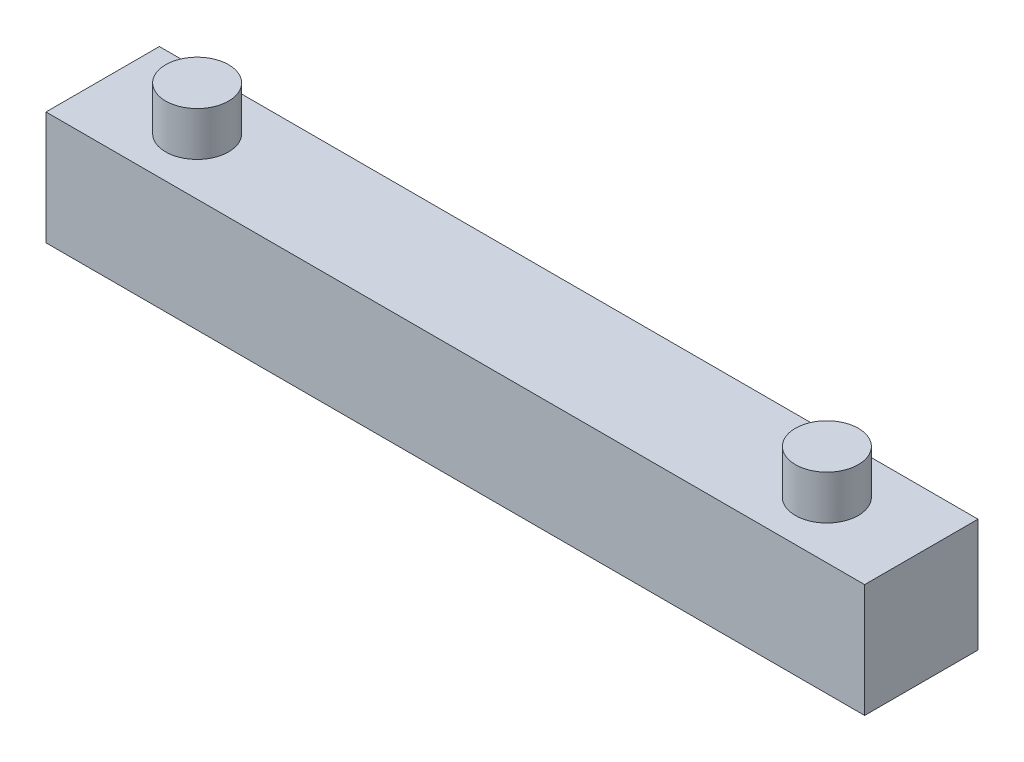
ISO-10303-21;
HEADER;
FILE_DESCRIPTION(('STEP AP214'),'2;1');
FILE_NAME('part.step','',(''),(''),'','','');
FILE_SCHEMA(('AUTOMOTIVE_DESIGN { 1 0 10303 214 1 1 1 1 }'));
ENDSEC;
DATA;
#1=APPLICATION_CONTEXT('core data for automotive mechanical design processes');
#2=APPLICATION_PROTOCOL_DEFINITION('international standard','automotive_design',2000,#1);
#3=PRODUCT_CONTEXT('',#1,'mechanical');
#4=PRODUCT('Part','Part','',(#3));
#5=PRODUCT_RELATED_PRODUCT_CATEGORY('part','',(#4));
#6=PRODUCT_DEFINITION_FORMATION('','',#4);
#7=PRODUCT_DEFINITION_CONTEXT('part definition',#1,'design');
#8=PRODUCT_DEFINITION('design','',#6,#7);
#9=PRODUCT_DEFINITION_SHAPE('','',#8);
#10=(LENGTH_UNIT() NAMED_UNIT(*) SI_UNIT(.MILLI.,.METRE.));
#11=(NAMED_UNIT(*) PLANE_ANGLE_UNIT() SI_UNIT($,.RADIAN.));
#12=(NAMED_UNIT(*) SI_UNIT($,.STERADIAN.) SOLID_ANGLE_UNIT());
#13=UNCERTAINTY_MEASURE_WITH_UNIT(LENGTH_MEASURE(1.E-05),#10,'distance_accuracy_value','');
#14=(GEOMETRIC_REPRESENTATION_CONTEXT(3) GLOBAL_UNCERTAINTY_ASSIGNED_CONTEXT((#13)) GLOBAL_UNIT_ASSIGNED_CONTEXT((#10,
#11,#12)) REPRESENTATION_CONTEXT('',''));
#15=CARTESIAN_POINT('',(0.,0.,0.));
#16=DIRECTION('',(0.,0.,1.));
#17=DIRECTION('',(1.,0.,0.));
#18=AXIS2_PLACEMENT_3D('',#15,#16,#17);
#19=CARTESIAN_POINT('',(65.,9.,9.));
#20=DIRECTION('',(0.,-1.,0.));
#21=DIRECTION('',(1.,0.,0.));
#22=AXIS2_PLACEMENT_3D('',#19,#20,#21);
#23=PLANE('',#22);
#24=CARTESIAN_POINT('',(57.5,9.,4.5));
#25=DIRECTION('',(0.,-1.,0.));
#26=DIRECTION('',(1.,0.,0.));
#27=AXIS2_PLACEMENT_3D('',#24,#25,#26);
#28=CIRCLE('',#27,2.49999999999999);
#29=CARTESIAN_POINT('',(60.,9.,4.5));
#30=VERTEX_POINT('',#29);
#31=EDGE_CURVE('E42',#30,#30,#28,.F.);
#32=ORIENTED_EDGE('',*,*,#31,.F.);
#33=EDGE_LOOP('',(#32));
#34=FACE_BOUND('',#33,.T.);
#35=DIRECTION('',(-1.,0.,0.));
#36=VECTOR('',#35,1.);
#37=CARTESIAN_POINT('',(65.,9.,0.));
#38=LINE('',#37,#36);
#39=CARTESIAN_POINT('',(65.,9.,0.));
#40=VERTEX_POINT('',#39);
#41=CARTESIAN_POINT('',(0.,8.99999999999999,0.));
#42=VERTEX_POINT('',#41);
#43=EDGE_CURVE('E73',#40,#42,#38,.T.);
#44=ORIENTED_EDGE('',*,*,#43,.T.);
#45=DIRECTION('',(0.,0.,-1.));
#46=VECTOR('',#45,1.);
#47=CARTESIAN_POINT('',(0.,8.99999999999999,9.));
#48=LINE('',#47,#46);
#49=CARTESIAN_POINT('',(0.,8.99999999999999,9.));
#50=VERTEX_POINT('',#49);
#51=EDGE_CURVE('E97',#50,#42,#48,.T.);
#52=ORIENTED_EDGE('',*,*,#51,.F.);
#53=DIRECTION('',(-1.,0.,0.));
#54=VECTOR('',#53,1.);
#55=CARTESIAN_POINT('',(65.,9.,9.));
#56=LINE('',#55,#54);
#57=CARTESIAN_POINT('',(65.,9.,9.));
#58=VERTEX_POINT('',#57);
#59=EDGE_CURVE('E50',#58,#50,#56,.T.);
#60=ORIENTED_EDGE('',*,*,#59,.F.);
#61=DIRECTION('',(0.,0.,-1.));
#62=VECTOR('',#61,1.);
#63=CARTESIAN_POINT('',(65.,9.,9.));
#64=LINE('',#63,#62);
#65=EDGE_CURVE('E93',#58,#40,#64,.T.);
#66=ORIENTED_EDGE('',*,*,#65,.T.);
#67=EDGE_LOOP('',(#44,#52,#60,#66));
#68=FACE_BOUND('',#67,.T.);
#69=CARTESIAN_POINT('',(7.5,8.99999999999999,4.5));
#70=DIRECTION('',(0.,-1.,0.));
#71=DIRECTION('',(1.,0.,0.));
#72=AXIS2_PLACEMENT_3D('',#69,#70,#71);
#73=CIRCLE('',#72,2.5);
#74=CARTESIAN_POINT('',(10.,8.99999999999999,4.5));
#75=VERTEX_POINT('',#74);
#76=EDGE_CURVE('E11',#75,#75,#73,.F.);
#77=ORIENTED_EDGE('',*,*,#76,.F.);
#78=EDGE_LOOP('',(#77));
#79=FACE_BOUND('',#78,.T.);
#80=ADVANCED_FACE('F33',(#34,#68,#79),#23,.F.);
#81=CARTESIAN_POINT('',(0.,8.99999999999999,9.));
#82=DIRECTION('',(1.,0.,0.));
#83=DIRECTION('',(0.,0.,-1.));
#84=AXIS2_PLACEMENT_3D('',#81,#82,#83);
#85=PLANE('',#84);
#86=DIRECTION('',(0.,-1.,0.));
#87=VECTOR('',#86,1.);
#88=CARTESIAN_POINT('',(0.,8.99999999999999,0.));
#89=LINE('',#88,#87);
#90=CARTESIAN_POINT('',(0.,0.,0.));
#91=VERTEX_POINT('',#90);
#92=EDGE_CURVE('E101',#42,#91,#89,.T.);
#93=ORIENTED_EDGE('',*,*,#92,.T.);
#94=DIRECTION('',(0.,0.,-1.));
#95=VECTOR('',#94,1.);
#96=CARTESIAN_POINT('',(0.,0.,9.));
#97=LINE('',#96,#95);
#98=CARTESIAN_POINT('',(0.,0.,9.));
#99=VERTEX_POINT('',#98);
#100=EDGE_CURVE('E92',#99,#91,#97,.T.);
#101=ORIENTED_EDGE('',*,*,#100,.F.);
#102=DIRECTION('',(0.,-1.,0.));
#103=VECTOR('',#102,1.);
#104=CARTESIAN_POINT('',(0.,8.99999999999999,9.));
#105=LINE('',#104,#103);
#106=EDGE_CURVE('E86',#50,#99,#105,.T.);
#107=ORIENTED_EDGE('',*,*,#106,.F.);
#108=ORIENTED_EDGE('',*,*,#51,.T.);
#109=EDGE_LOOP('',(#93,#101,#107,#108));
#110=FACE_BOUND('',#109,.T.);
#111=ADVANCED_FACE('F35',(#110),#85,.F.);
#112=CARTESIAN_POINT('',(0.,0.,9.));
#113=DIRECTION('',(0.,1.,0.));
#114=DIRECTION('',(0.,0.,1.));
#115=AXIS2_PLACEMENT_3D('',#112,#113,#114);
#116=PLANE('',#115);
#117=DIRECTION('',(1.,0.,0.));
#118=VECTOR('',#117,1.);
#119=CARTESIAN_POINT('',(0.,0.,0.));
#120=LINE('',#119,#118);
#121=CARTESIAN_POINT('',(65.,0.,0.));
#122=VERTEX_POINT('',#121);
#123=EDGE_CURVE('E91',#91,#122,#120,.T.);
#124=ORIENTED_EDGE('',*,*,#123,.T.);
#125=DIRECTION('',(0.,0.,-1.));
#126=VECTOR('',#125,1.);
#127=CARTESIAN_POINT('',(65.,0.,9.));
#128=LINE('',#127,#126);
#129=CARTESIAN_POINT('',(65.,0.,9.));
#130=VERTEX_POINT('',#129);
#131=EDGE_CURVE('E89',#130,#122,#128,.T.);
#132=ORIENTED_EDGE('',*,*,#131,.F.);
#133=DIRECTION('',(1.,0.,0.));
#134=VECTOR('',#133,1.);
#135=CARTESIAN_POINT('',(0.,0.,9.));
#136=LINE('',#135,#134);
#137=EDGE_CURVE('E81',#99,#130,#136,.T.);
#138=ORIENTED_EDGE('',*,*,#137,.F.);
#139=ORIENTED_EDGE('',*,*,#100,.T.);
#140=EDGE_LOOP('',(#124,#132,#138,#139));
#141=FACE_BOUND('',#140,.T.);
#142=ADVANCED_FACE('F90',(#141),#116,.F.);
#143=CARTESIAN_POINT('',(65.,0.,9.));
#144=DIRECTION('',(-1.,0.,0.));
#145=DIRECTION('',(0.,0.,1.));
#146=AXIS2_PLACEMENT_3D('',#143,#144,#145);
#147=PLANE('',#146);
#148=DIRECTION('',(0.,1.,0.));
#149=VECTOR('',#148,1.);
#150=CARTESIAN_POINT('',(65.,0.,0.));
#151=LINE('',#150,#149);
#152=EDGE_CURVE('E67',#122,#40,#151,.T.);
#153=ORIENTED_EDGE('',*,*,#152,.T.);
#154=ORIENTED_EDGE('',*,*,#65,.F.);
#155=DIRECTION('',(0.,1.,0.));
#156=VECTOR('',#155,1.);
#157=CARTESIAN_POINT('',(65.,0.,9.));
#158=LINE('',#157,#156);
#159=EDGE_CURVE('E84',#130,#58,#158,.T.);
#160=ORIENTED_EDGE('',*,*,#159,.F.);
#161=ORIENTED_EDGE('',*,*,#131,.T.);
#162=EDGE_LOOP('',(#153,#154,#160,#161));
#163=FACE_BOUND('',#162,.T.);
#164=ADVANCED_FACE('F95',(#163),#147,.F.);
#165=CARTESIAN_POINT('',(0.,0.,9.));
#166=DIRECTION('',(0.,0.,1.));
#167=DIRECTION('',(1.,0.,0.));
#168=AXIS2_PLACEMENT_3D('',#165,#166,#167);
#169=PLANE('',#168);
#170=ORIENTED_EDGE('',*,*,#106,.T.);
#171=ORIENTED_EDGE('',*,*,#137,.T.);
#172=ORIENTED_EDGE('',*,*,#159,.T.);
#173=ORIENTED_EDGE('',*,*,#59,.T.);
#174=EDGE_LOOP('',(#170,#171,#172,#173));
#175=FACE_BOUND('',#174,.T.);
#176=ADVANCED_FACE('F82',(#175),#169,.T.);
#177=CARTESIAN_POINT('',(0.,0.,0.));
#178=DIRECTION('',(0.,0.,1.));
#179=DIRECTION('',(1.,0.,0.));
#180=AXIS2_PLACEMENT_3D('',#177,#178,#179);
#181=PLANE('',#180);
#182=ORIENTED_EDGE('',*,*,#92,.F.);
#183=ORIENTED_EDGE('',*,*,#43,.F.);
#184=ORIENTED_EDGE('',*,*,#152,.F.);
#185=ORIENTED_EDGE('',*,*,#123,.F.);
#186=EDGE_LOOP('',(#182,#183,#184,#185));
#187=FACE_BOUND('',#186,.T.);
#188=ADVANCED_FACE('F138',(#187),#181,.F.);
#189=CARTESIAN_POINT('',(57.5,12.5,4.5));
#190=DIRECTION('',(0.,-1.,0.));
#191=DIRECTION('',(1.,0.,0.));
#192=AXIS2_PLACEMENT_3D('',#189,#190,#191);
#193=CYLINDRICAL_SURFACE('',#192,2.49999999999999);
#194=CARTESIAN_POINT('',(57.5,12.5,4.5));
#195=DIRECTION('',(0.,1.,0.));
#196=DIRECTION('',(-1.,0.,0.));
#197=AXIS2_PLACEMENT_3D('',#194,#195,#196);
#198=CIRCLE('',#197,2.49999999999999);
#199=CARTESIAN_POINT('',(55.,12.5,4.5));
#200=VERTEX_POINT('',#199);
#201=EDGE_CURVE('E104',#200,#200,#198,.T.);
#202=ORIENTED_EDGE('',*,*,#201,.F.);
#203=EDGE_LOOP('',(#202));
#204=FACE_BOUND('',#203,.T.);
#205=ORIENTED_EDGE('',*,*,#31,.T.);
#206=EDGE_LOOP('',(#205));
#207=FACE_BOUND('',#206,.T.);
#208=ADVANCED_FACE('F113',(#204,#207),#193,.T.);
#209=CARTESIAN_POINT('',(0.,12.5,0.));
#210=DIRECTION('',(0.,1.,0.));
#211=DIRECTION('',(-1.,0.,0.));
#212=AXIS2_PLACEMENT_3D('',#209,#210,#211);
#213=PLANE('',#212);
#214=ORIENTED_EDGE('',*,*,#201,.T.);
#215=EDGE_LOOP('',(#214));
#216=FACE_BOUND('',#215,.T.);
#217=ADVANCED_FACE('F123',(#216),#213,.T.);
#218=CARTESIAN_POINT('',(7.5,12.5,4.5));
#219=DIRECTION('',(0.,-1.,0.));
#220=DIRECTION('',(1.,0.,0.));
#221=AXIS2_PLACEMENT_3D('',#218,#219,#220);
#222=CYLINDRICAL_SURFACE('',#221,2.5);
#223=CARTESIAN_POINT('',(7.5,12.5,4.5));
#224=DIRECTION('',(0.,1.,0.));
#225=DIRECTION('',(-1.,0.,0.));
#226=AXIS2_PLACEMENT_3D('',#223,#224,#225);
#227=CIRCLE('',#226,2.5);
#228=CARTESIAN_POINT('',(5.,12.5,4.5));
#229=VERTEX_POINT('',#228);
#230=EDGE_CURVE('E157',#229,#229,#227,.T.);
#231=ORIENTED_EDGE('',*,*,#230,.F.);
#232=EDGE_LOOP('',(#231));
#233=FACE_BOUND('',#232,.T.);
#234=ORIENTED_EDGE('',*,*,#76,.T.);
#235=EDGE_LOOP('',(#234));
#236=FACE_BOUND('',#235,.T.);
#237=ADVANCED_FACE('F120',(#233,#236),#222,.T.);
#238=CARTESIAN_POINT('',(7.5,12.5,4.5));
#239=DIRECTION('',(0.,1.,0.));
#240=DIRECTION('',(-1.,0.,0.));
#241=AXIS2_PLACEMENT_3D('',#238,#239,#240);
#242=PLANE('',#241);
#243=ORIENTED_EDGE('',*,*,#230,.T.);
#244=EDGE_LOOP('',(#243));
#245=FACE_BOUND('',#244,.T.);
#246=ADVANCED_FACE('F122',(#245),#242,.T.);
#247=CLOSED_SHELL('',(#80,#111,#142,#164,#176,#188,#208,#217,#237,#246));
#248=MANIFOLD_SOLID_BREP('B2',#247);
#249=ADVANCED_BREP_SHAPE_REPRESENTATION('',(#18,#248),#14);
#250=SHAPE_DEFINITION_REPRESENTATION(#9,#249);
ENDSEC;
END-ISO-10303-21;
